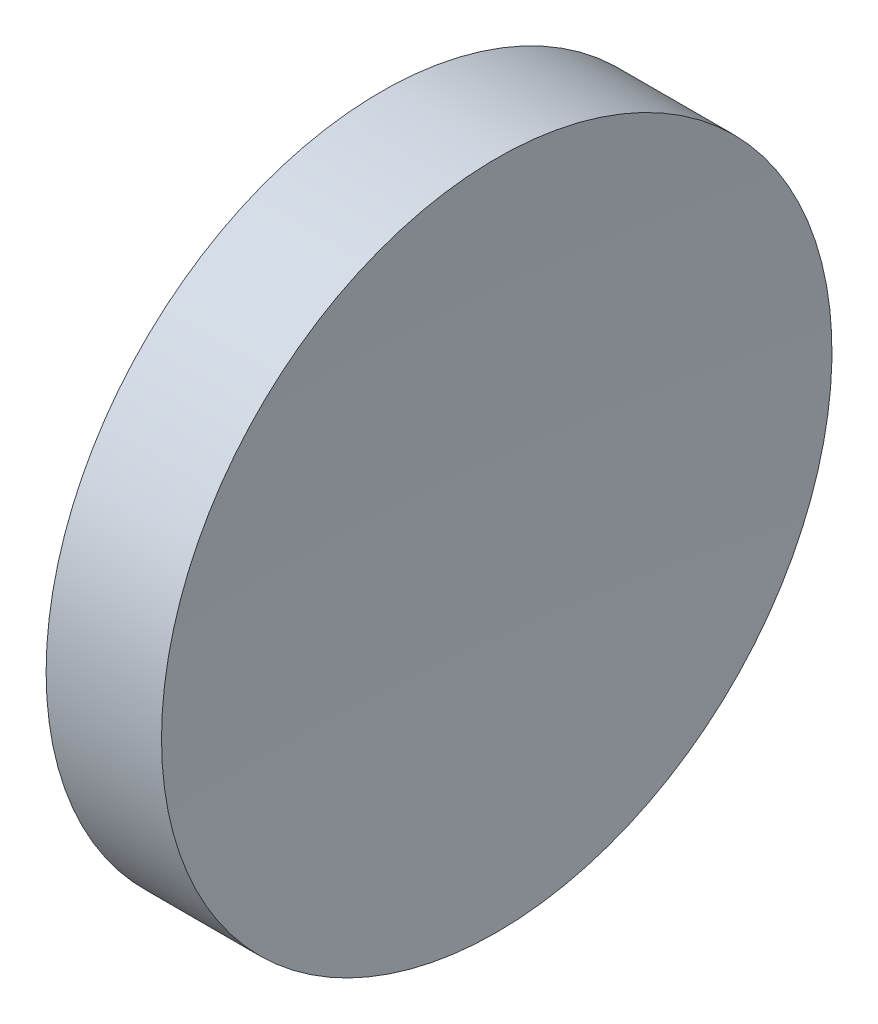
ISO-10303-21;
HEADER;
FILE_DESCRIPTION(('STEP AP214'),'2;1');
FILE_NAME('part.step','',(''),(''),'','','');
FILE_SCHEMA(('AUTOMOTIVE_DESIGN { 1 0 10303 214 1 1 1 1 }'));
ENDSEC;
DATA;
#1=APPLICATION_CONTEXT('core data for automotive mechanical design processes');
#2=APPLICATION_PROTOCOL_DEFINITION('international standard','automotive_design',2000,#1);
#3=PRODUCT_CONTEXT('',#1,'mechanical');
#4=PRODUCT('Part','Part','',(#3));
#5=PRODUCT_RELATED_PRODUCT_CATEGORY('part','',(#4));
#6=PRODUCT_DEFINITION_FORMATION('','',#4);
#7=PRODUCT_DEFINITION_CONTEXT('part definition',#1,'design');
#8=PRODUCT_DEFINITION('design','',#6,#7);
#9=PRODUCT_DEFINITION_SHAPE('','',#8);
#10=(LENGTH_UNIT() NAMED_UNIT(*) SI_UNIT(.MILLI.,.METRE.));
#11=(NAMED_UNIT(*) PLANE_ANGLE_UNIT() SI_UNIT($,.RADIAN.));
#12=(NAMED_UNIT(*) SI_UNIT($,.STERADIAN.) SOLID_ANGLE_UNIT());
#13=UNCERTAINTY_MEASURE_WITH_UNIT(LENGTH_MEASURE(1.E-05),#10,'distance_accuracy_value','');
#14=(GEOMETRIC_REPRESENTATION_CONTEXT(3) GLOBAL_UNCERTAINTY_ASSIGNED_CONTEXT((#13)) GLOBAL_UNIT_ASSIGNED_CONTEXT((#10,
#11,#12)) REPRESENTATION_CONTEXT('',''));
#15=CARTESIAN_POINT('',(0.,0.,0.));
#16=DIRECTION('',(0.,0.,1.));
#17=DIRECTION('',(1.,0.,0.));
#18=AXIS2_PLACEMENT_3D('',#15,#16,#17);
#19=CARTESIAN_POINT('',(340.406834178548,71.1939890865937,0.));
#20=DIRECTION('',(-1.,0.,0.));
#21=DIRECTION('',(0.,-1.,0.));
#22=AXIS2_PLACEMENT_3D('',#19,#20,#21);
#23=SPHERICAL_SURFACE('',#22,216.9);
#24=CARTESIAN_POINT('',(123.878960684164,71.1939890865937,0.));
#25=DIRECTION('',(-1.,0.,0.));
#26=DIRECTION('',(0.,0.,1.));
#27=AXIS2_PLACEMENT_3D('',#24,#25,#26);
#28=CIRCLE('',#27,12.7);
#29=CARTESIAN_POINT('',(123.878960684164,71.1939890865937,12.7));
#30=VERTEX_POINT('',#29);
#31=EDGE_CURVE('E10',#30,#30,#28,.T.);
#32=ORIENTED_EDGE('',*,*,#31,.F.);
#33=EDGE_LOOP('',(#32));
#34=FACE_BOUND('',#33,.T.);
#35=ADVANCED_FACE('F35',(#34),#23,.F.);
#36=CARTESIAN_POINT('',(111.955229757561,71.1939890865937,0.));
#37=DIRECTION('',(-1.,0.,0.));
#38=DIRECTION('',(0.,0.,1.));
#39=AXIS2_PLACEMENT_3D('',#36,#37,#38);
#40=CYLINDRICAL_SURFACE('',#39,12.7);
#41=CARTESIAN_POINT('',(119.506834178548,71.1939890865937,0.));
#42=DIRECTION('',(-1.,0.,0.));
#43=DIRECTION('',(0.,0.,1.));
#44=AXIS2_PLACEMENT_3D('',#41,#42,#43);
#45=CIRCLE('',#44,12.7);
#46=CARTESIAN_POINT('',(119.506834178548,71.1939890865937,12.7));
#47=VERTEX_POINT('',#46);
#48=EDGE_CURVE('E41',#47,#47,#45,.T.);
#49=ORIENTED_EDGE('',*,*,#48,.F.);
#50=EDGE_LOOP('',(#49));
#51=FACE_BOUND('',#50,.T.);
#52=ORIENTED_EDGE('',*,*,#31,.T.);
#53=EDGE_LOOP('',(#52));
#54=FACE_BOUND('',#53,.T.);
#55=ADVANCED_FACE('F49',(#51,#54),#40,.T.);
#56=CARTESIAN_POINT('',(119.506834178548,71.1939890865937,0.));
#57=DIRECTION('',(1.,0.,0.));
#58=DIRECTION('',(0.,0.,-1.));
#59=AXIS2_PLACEMENT_3D('',#56,#57,#58);
#60=PLANE('',#59);
#61=ORIENTED_EDGE('',*,*,#48,.T.);
#62=EDGE_LOOP('',(#61));
#63=FACE_BOUND('',#62,.T.);
#64=ADVANCED_FACE('F47',(#63),#60,.F.);
#65=CLOSED_SHELL('',(#35,#55,#64));
#66=MANIFOLD_SOLID_BREP('B2',#65);
#67=ADVANCED_BREP_SHAPE_REPRESENTATION('',(#18,#66),#14);
#68=SHAPE_DEFINITION_REPRESENTATION(#9,#67);
ENDSEC;
END-ISO-10303-21;
